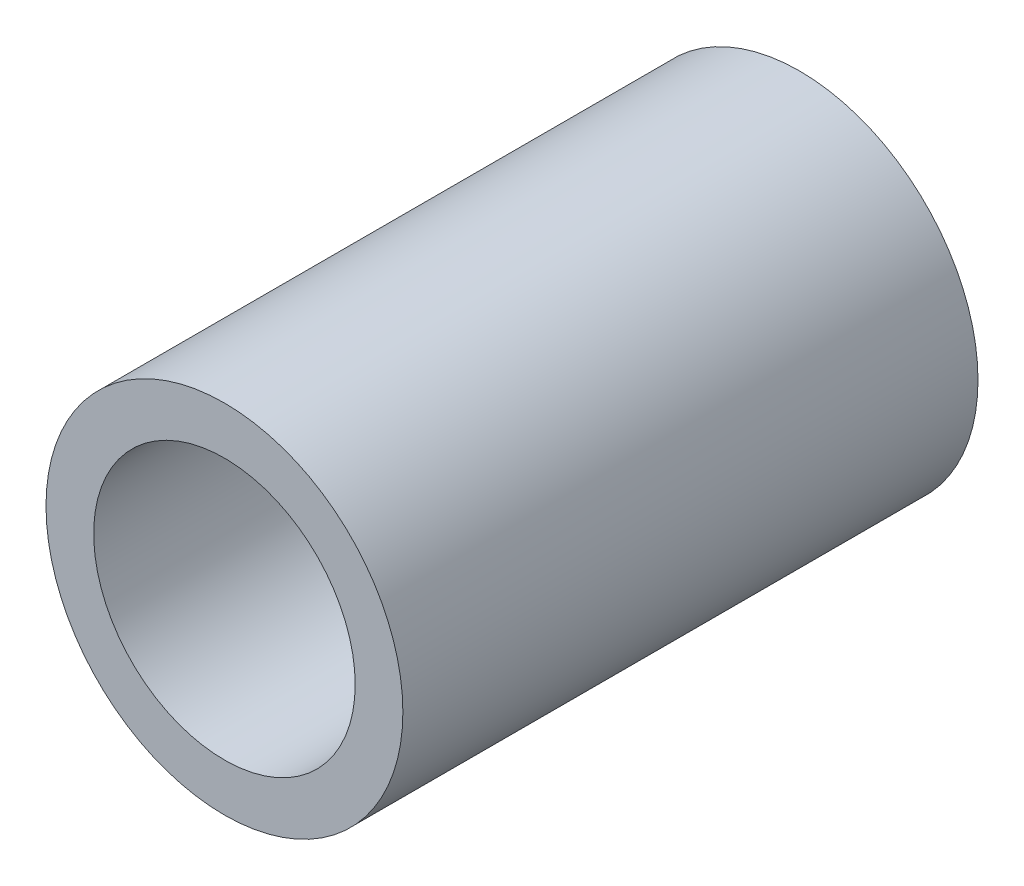
ISO-10303-21;
HEADER;
FILE_DESCRIPTION(('STEP AP214'),'2;1');
FILE_NAME('part.step','',(''),(''),'','','');
FILE_SCHEMA(('AUTOMOTIVE_DESIGN { 1 0 10303 214 1 1 1 1 }'));
ENDSEC;
DATA;
#1=APPLICATION_CONTEXT('core data for automotive mechanical design processes');
#2=APPLICATION_PROTOCOL_DEFINITION('international standard','automotive_design',2000,#1);
#3=PRODUCT_CONTEXT('',#1,'mechanical');
#4=PRODUCT('Part','Part','',(#3));
#5=PRODUCT_RELATED_PRODUCT_CATEGORY('part','',(#4));
#6=PRODUCT_DEFINITION_FORMATION('','',#4);
#7=PRODUCT_DEFINITION_CONTEXT('part definition',#1,'design');
#8=PRODUCT_DEFINITION('design','',#6,#7);
#9=PRODUCT_DEFINITION_SHAPE('','',#8);
#10=(LENGTH_UNIT() NAMED_UNIT(*) SI_UNIT(.MILLI.,.METRE.));
#11=(NAMED_UNIT(*) PLANE_ANGLE_UNIT() SI_UNIT($,.RADIAN.));
#12=(NAMED_UNIT(*) SI_UNIT($,.STERADIAN.) SOLID_ANGLE_UNIT());
#13=UNCERTAINTY_MEASURE_WITH_UNIT(LENGTH_MEASURE(1.E-05),#10,'distance_accuracy_value','');
#14=(GEOMETRIC_REPRESENTATION_CONTEXT(3) GLOBAL_UNCERTAINTY_ASSIGNED_CONTEXT((#13)) GLOBAL_UNIT_ASSIGNED_CONTEXT((#10,
#11,#12)) REPRESENTATION_CONTEXT('',''));
#15=CARTESIAN_POINT('',(0.,0.,0.));
#16=DIRECTION('',(0.,0.,1.));
#17=DIRECTION('',(1.,0.,0.));
#18=AXIS2_PLACEMENT_3D('',#15,#16,#17);
#19=CARTESIAN_POINT('',(0.,0.,-14.859));
#20=DIRECTION('',(0.,0.,1.));
#21=DIRECTION('',(1.,0.,0.));
#22=AXIS2_PLACEMENT_3D('',#19,#20,#21);
#23=CYLINDRICAL_SURFACE('',#22,4.6101);
#24=CARTESIAN_POINT('',(0.,0.,-14.859));
#25=DIRECTION('',(0.,0.,1.));
#26=DIRECTION('',(1.,0.,0.));
#27=AXIS2_PLACEMENT_3D('',#24,#25,#26);
#28=CIRCLE('',#27,4.6101);
#29=CARTESIAN_POINT('',(4.6101,0.,-14.859));
#30=VERTEX_POINT('',#29);
#31=EDGE_CURVE('E10',#30,#30,#28,.T.);
#32=ORIENTED_EDGE('',*,*,#31,.T.);
#33=EDGE_LOOP('',(#32));
#34=FACE_BOUND('',#33,.T.);
#35=CARTESIAN_POINT('',(0.,0.,0.));
#36=DIRECTION('',(0.,0.,1.));
#37=DIRECTION('',(1.,0.,0.));
#38=AXIS2_PLACEMENT_3D('',#35,#36,#37);
#39=CIRCLE('',#38,4.6101);
#40=CARTESIAN_POINT('',(4.6101,0.,0.));
#41=VERTEX_POINT('',#40);
#42=EDGE_CURVE('E41',#41,#41,#39,.T.);
#43=ORIENTED_EDGE('',*,*,#42,.F.);
#44=EDGE_LOOP('',(#43));
#45=FACE_BOUND('',#44,.T.);
#46=ADVANCED_FACE('F38',(#34,#45),#23,.T.);
#47=CARTESIAN_POINT('',(0.,0.,-14.859));
#48=DIRECTION('',(0.,0.,1.));
#49=DIRECTION('',(1.,0.,0.));
#50=AXIS2_PLACEMENT_3D('',#47,#48,#49);
#51=PLANE('',#50);
#52=CARTESIAN_POINT('',(0.,0.,-14.859));
#53=DIRECTION('',(0.,0.,1.));
#54=DIRECTION('',(1.,0.,0.));
#55=AXIS2_PLACEMENT_3D('',#52,#53,#54);
#56=CIRCLE('',#55,3.3782);
#57=CARTESIAN_POINT('',(3.3782,0.,-14.859));
#58=VERTEX_POINT('',#57);
#59=EDGE_CURVE('E51',#58,#58,#56,.T.);
#60=ORIENTED_EDGE('',*,*,#59,.T.);
#61=EDGE_LOOP('',(#60));
#62=FACE_BOUND('',#61,.T.);
#63=ORIENTED_EDGE('',*,*,#31,.F.);
#64=EDGE_LOOP('',(#63));
#65=FACE_BOUND('',#64,.T.);
#66=ADVANCED_FACE('F67',(#62,#65),#51,.F.);
#67=CARTESIAN_POINT('',(0.,0.,0.));
#68=DIRECTION('',(0.,0.,1.));
#69=DIRECTION('',(1.,0.,0.));
#70=AXIS2_PLACEMENT_3D('',#67,#68,#69);
#71=PLANE('',#70);
#72=CARTESIAN_POINT('',(0.,0.,0.));
#73=DIRECTION('',(0.,0.,1.));
#74=DIRECTION('',(1.,0.,0.));
#75=AXIS2_PLACEMENT_3D('',#72,#73,#74);
#76=CIRCLE('',#75,3.3782);
#77=CARTESIAN_POINT('',(3.3782,0.,0.));
#78=VERTEX_POINT('',#77);
#79=EDGE_CURVE('E56',#78,#78,#76,.T.);
#80=ORIENTED_EDGE('',*,*,#79,.F.);
#81=EDGE_LOOP('',(#80));
#82=FACE_BOUND('',#81,.T.);
#83=ORIENTED_EDGE('',*,*,#42,.T.);
#84=EDGE_LOOP('',(#83));
#85=FACE_BOUND('',#84,.T.);
#86=ADVANCED_FACE('F64',(#82,#85),#71,.T.);
#87=CARTESIAN_POINT('',(0.,0.,0.));
#88=DIRECTION('',(0.,0.,1.));
#89=DIRECTION('',(1.,0.,0.));
#90=AXIS2_PLACEMENT_3D('',#87,#88,#89);
#91=CYLINDRICAL_SURFACE('',#90,3.3782);
#92=ORIENTED_EDGE('',*,*,#59,.F.);
#93=EDGE_LOOP('',(#92));
#94=FACE_BOUND('',#93,.T.);
#95=ORIENTED_EDGE('',*,*,#79,.T.);
#96=EDGE_LOOP('',(#95));
#97=FACE_BOUND('',#96,.T.);
#98=ADVANCED_FACE('F62',(#94,#97),#91,.F.);
#99=CLOSED_SHELL('',(#46,#66,#86,#98));
#100=MANIFOLD_SOLID_BREP('B2',#99);
#101=ADVANCED_BREP_SHAPE_REPRESENTATION('',(#18,#100),#14);
#102=SHAPE_DEFINITION_REPRESENTATION(#9,#101);
ENDSEC;
END-ISO-10303-21;
